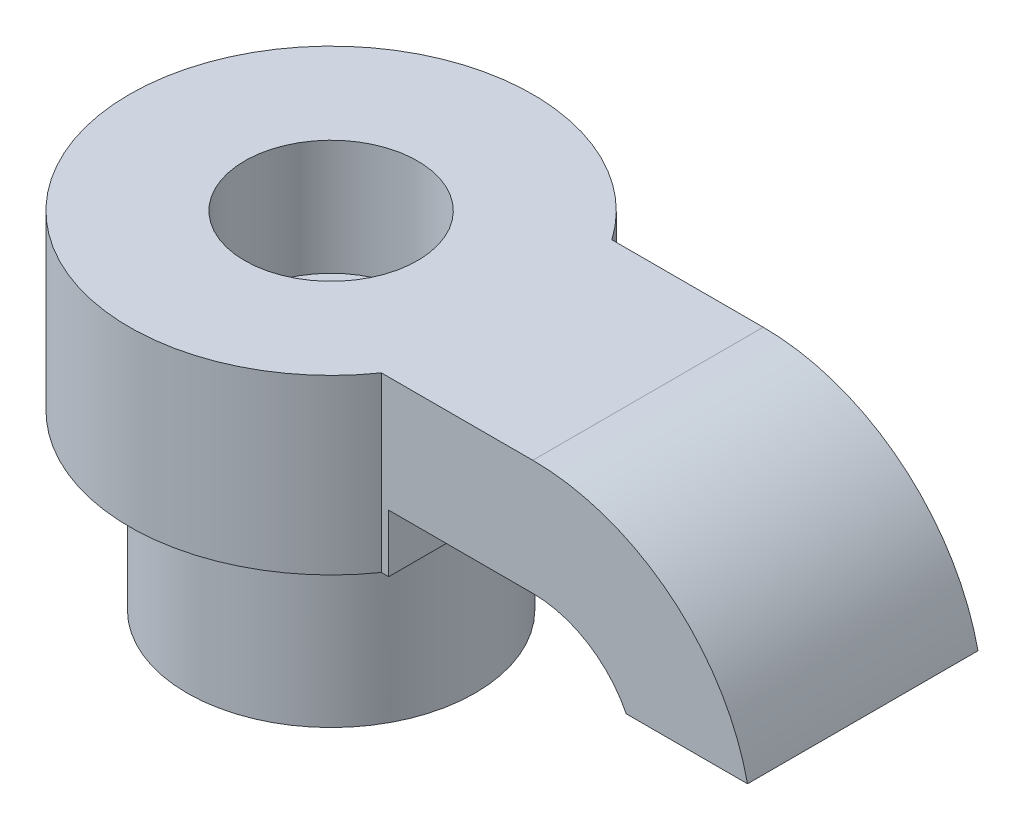
ISO-10303-21;
HEADER;
FILE_DESCRIPTION(('STEP AP214'),'2;1');
FILE_NAME('part.step','',(''),(''),'','','');
FILE_SCHEMA(('AUTOMOTIVE_DESIGN { 1 0 10303 214 1 1 1 1 }'));
ENDSEC;
DATA;
#1=APPLICATION_CONTEXT('core data for automotive mechanical design processes');
#2=APPLICATION_PROTOCOL_DEFINITION('international standard','automotive_design',2000,#1);
#3=PRODUCT_CONTEXT('',#1,'mechanical');
#4=PRODUCT('Part','Part','',(#3));
#5=PRODUCT_RELATED_PRODUCT_CATEGORY('part','',(#4));
#6=PRODUCT_DEFINITION_FORMATION('','',#4);
#7=PRODUCT_DEFINITION_CONTEXT('part definition',#1,'design');
#8=PRODUCT_DEFINITION('design','',#6,#7);
#9=PRODUCT_DEFINITION_SHAPE('','',#8);
#10=(LENGTH_UNIT() NAMED_UNIT(*) SI_UNIT(.MILLI.,.METRE.));
#11=(NAMED_UNIT(*) PLANE_ANGLE_UNIT() SI_UNIT($,.RADIAN.));
#12=(NAMED_UNIT(*) SI_UNIT($,.STERADIAN.) SOLID_ANGLE_UNIT());
#13=UNCERTAINTY_MEASURE_WITH_UNIT(LENGTH_MEASURE(1.E-05),#10,'distance_accuracy_value','');
#14=(GEOMETRIC_REPRESENTATION_CONTEXT(3) GLOBAL_UNCERTAINTY_ASSIGNED_CONTEXT((#13)) GLOBAL_UNIT_ASSIGNED_CONTEXT((#10,
#11,#12)) REPRESENTATION_CONTEXT('',''));
#15=CARTESIAN_POINT('',(0.,0.,0.));
#16=DIRECTION('',(0.,0.,1.));
#17=DIRECTION('',(1.,0.,0.));
#18=AXIS2_PLACEMENT_3D('',#15,#16,#17);
#19=CARTESIAN_POINT('',(-6.,-6.,4.));
#20=DIRECTION('',(0.,1.,0.));
#21=DIRECTION('',(0.,0.,1.));
#22=AXIS2_PLACEMENT_3D('',#19,#20,#21);
#23=PLANE('',#22);
#24=CARTESIAN_POINT('',(-6.,-6.,4.));
#25=DIRECTION('',(0.,1.,0.));
#26=DIRECTION('',(0.,0.,1.));
#27=AXIS2_PLACEMENT_3D('',#24,#25,#26);
#28=CIRCLE('',#27,7.);
#29=CARTESIAN_POINT('',(-0.255437353461972,-6.,0.));
#30=VERTEX_POINT('',#29);
#31=CARTESIAN_POINT('',(-0.255437353461972,-6.,8.));
#32=VERTEX_POINT('',#31);
#33=EDGE_CURVE('E129',#30,#32,#28,.T.);
#34=ORIENTED_EDGE('',*,*,#33,.F.);
#35=DIRECTION('',(-1.,0.,0.));
#36=VECTOR('',#35,1.);
#37=CARTESIAN_POINT('',(-0.255437353461972,-6.,0.));
#38=LINE('',#37,#36);
#39=CARTESIAN_POINT('',(0.,-6.,0.));
#40=VERTEX_POINT('',#39);
#41=EDGE_CURVE('E122',#40,#30,#38,.T.);
#42=ORIENTED_EDGE('',*,*,#41,.F.);
#43=DIRECTION('',(0.,0.,-1.));
#44=VECTOR('',#43,1.);
#45=CARTESIAN_POINT('',(0.,-6.,0.));
#46=LINE('',#45,#44);
#47=CARTESIAN_POINT('',(0.,-6.,8.));
#48=VERTEX_POINT('',#47);
#49=EDGE_CURVE('E132',#48,#40,#46,.T.);
#50=ORIENTED_EDGE('',*,*,#49,.F.);
#51=DIRECTION('',(1.,0.,0.));
#52=VECTOR('',#51,1.);
#53=CARTESIAN_POINT('',(0.,-6.,8.));
#54=LINE('',#53,#52);
#55=EDGE_CURVE('E114',#32,#48,#54,.T.);
#56=ORIENTED_EDGE('',*,*,#55,.F.);
#57=EDGE_LOOP('',(#34,#42,#50,#56));
#58=FACE_BOUND('',#57,.T.);
#59=CARTESIAN_POINT('',(-6.,-6.,4.));
#60=DIRECTION('',(0.,1.,0.));
#61=DIRECTION('',(0.,0.,1.));
#62=AXIS2_PLACEMENT_3D('',#59,#60,#61);
#63=CIRCLE('',#62,5.);
#64=CARTESIAN_POINT('',(-6.,-6.,9.));
#65=VERTEX_POINT('',#64);
#66=EDGE_CURVE('E11',#65,#65,#63,.F.);
#67=ORIENTED_EDGE('',*,*,#66,.F.);
#68=EDGE_LOOP('',(#67));
#69=FACE_BOUND('',#68,.T.);
#70=ADVANCED_FACE('F36',(#58,#69),#23,.F.);
#71=CARTESIAN_POINT('',(0.,-4.,8.));
#72=DIRECTION('',(0.,1.,0.));
#73=DIRECTION('',(0.,0.,1.));
#74=AXIS2_PLACEMENT_3D('',#71,#72,#73);
#75=PLANE('',#74);
#76=DIRECTION('',(1.,0.,0.));
#77=VECTOR('',#76,1.);
#78=CARTESIAN_POINT('',(0.,-4.,0.));
#79=LINE('',#78,#77);
#80=CARTESIAN_POINT('',(0.,-4.,0.));
#81=VERTEX_POINT('',#80);
#82=CARTESIAN_POINT('',(5.,-4.,0.));
#83=VERTEX_POINT('',#82);
#84=EDGE_CURVE('E147',#81,#83,#79,.T.);
#85=ORIENTED_EDGE('',*,*,#84,.T.);
#86=DIRECTION('',(0.,0.,-1.));
#87=VECTOR('',#86,1.);
#88=CARTESIAN_POINT('',(5.,-4.,8.));
#89=LINE('',#88,#87);
#90=CARTESIAN_POINT('',(5.,-4.,8.));
#91=VERTEX_POINT('',#90);
#92=EDGE_CURVE('E173',#91,#83,#89,.T.);
#93=ORIENTED_EDGE('',*,*,#92,.F.);
#94=DIRECTION('',(1.,0.,0.));
#95=VECTOR('',#94,1.);
#96=CARTESIAN_POINT('',(0.,-4.,8.));
#97=LINE('',#96,#95);
#98=CARTESIAN_POINT('',(0.,-4.,8.));
#99=VERTEX_POINT('',#98);
#100=EDGE_CURVE('E88',#99,#91,#97,.T.);
#101=ORIENTED_EDGE('',*,*,#100,.F.);
#102=DIRECTION('',(0.,0.,-1.));
#103=VECTOR('',#102,1.);
#104=CARTESIAN_POINT('',(0.,-4.,8.));
#105=LINE('',#104,#103);
#106=EDGE_CURVE('E46',#99,#81,#105,.T.);
#107=ORIENTED_EDGE('',*,*,#106,.T.);
#108=EDGE_LOOP('',(#85,#93,#101,#107));
#109=FACE_BOUND('',#108,.T.);
#110=ADVANCED_FACE('F38',(#109),#75,.F.);
#111=CARTESIAN_POINT('',(5.,-7.63014946104609,8.));
#112=DIRECTION('',(0.,0.,-1.));
#113=DIRECTION('',(-1.,0.,0.));
#114=AXIS2_PLACEMENT_3D('',#111,#112,#113);
#115=CYLINDRICAL_SURFACE('',#114,3.63014946104609);
#116=CARTESIAN_POINT('',(5.,-7.63014946104609,0.));
#117=DIRECTION('',(0.,0.,-1.));
#118=DIRECTION('',(-1.,0.,0.));
#119=AXIS2_PLACEMENT_3D('',#116,#117,#118);
#120=CIRCLE('',#119,3.63014946104609);
#121=CARTESIAN_POINT('',(8.24354710836522,-6.,0.));
#122=VERTEX_POINT('',#121);
#123=EDGE_CURVE('E162',#83,#122,#120,.T.);
#124=ORIENTED_EDGE('',*,*,#123,.T.);
#125=DIRECTION('',(0.,0.,-1.));
#126=VECTOR('',#125,1.);
#127=CARTESIAN_POINT('',(8.24354710836522,-6.,8.));
#128=LINE('',#127,#126);
#129=CARTESIAN_POINT('',(8.24354710836522,-6.,8.));
#130=VERTEX_POINT('',#129);
#131=EDGE_CURVE('E171',#130,#122,#128,.T.);
#132=ORIENTED_EDGE('',*,*,#131,.F.);
#133=CARTESIAN_POINT('',(5.,-7.63014946104609,8.));
#134=DIRECTION('',(0.,0.,-1.));
#135=DIRECTION('',(-1.,0.,0.));
#136=AXIS2_PLACEMENT_3D('',#133,#134,#135);
#137=CIRCLE('',#136,3.63014946104609);
#138=EDGE_CURVE('E155',#91,#130,#137,.T.);
#139=ORIENTED_EDGE('',*,*,#138,.F.);
#140=ORIENTED_EDGE('',*,*,#92,.T.);
#141=EDGE_LOOP('',(#124,#132,#139,#140));
#142=FACE_BOUND('',#141,.T.);
#143=ADVANCED_FACE('F194',(#142),#115,.F.);
#144=CARTESIAN_POINT('',(8.24354710836522,-6.,8.));
#145=DIRECTION('',(0.,1.,0.));
#146=DIRECTION('',(0.,0.,1.));
#147=AXIS2_PLACEMENT_3D('',#144,#145,#146);
#148=PLANE('',#147);
#149=DIRECTION('',(1.,0.,0.));
#150=VECTOR('',#149,1.);
#151=CARTESIAN_POINT('',(8.24354710836522,-6.,0.));
#152=LINE('',#151,#150);
#153=CARTESIAN_POINT('',(12.4539783694718,-6.,0.));
#154=VERTEX_POINT('',#153);
#155=EDGE_CURVE('E75',#122,#154,#152,.T.);
#156=ORIENTED_EDGE('',*,*,#155,.T.);
#157=DIRECTION('',(0.,0.,-1.));
#158=VECTOR('',#157,1.);
#159=CARTESIAN_POINT('',(12.4539783694718,-6.,8.));
#160=LINE('',#159,#158);
#161=CARTESIAN_POINT('',(12.4539783694718,-6.,8.));
#162=VERTEX_POINT('',#161);
#163=EDGE_CURVE('E169',#162,#154,#160,.T.);
#164=ORIENTED_EDGE('',*,*,#163,.F.);
#165=DIRECTION('',(1.,0.,0.));
#166=VECTOR('',#165,1.);
#167=CARTESIAN_POINT('',(8.24354710836522,-6.,8.));
#168=LINE('',#167,#166);
#169=EDGE_CURVE('E157',#130,#162,#168,.T.);
#170=ORIENTED_EDGE('',*,*,#169,.F.);
#171=ORIENTED_EDGE('',*,*,#131,.T.);
#172=EDGE_LOOP('',(#156,#164,#170,#171));
#173=FACE_BOUND('',#172,.T.);
#174=ADVANCED_FACE('F197',(#173),#148,.F.);
#175=CARTESIAN_POINT('',(5.,-7.63014946104609,8.));
#176=DIRECTION('',(0.,0.,-1.));
#177=DIRECTION('',(-1.,0.,0.));
#178=AXIS2_PLACEMENT_3D('',#175,#176,#177);
#179=CYLINDRICAL_SURFACE('',#178,7.63014946104609);
#180=CARTESIAN_POINT('',(5.,-7.63014946104609,0.));
#181=DIRECTION('',(0.,0.,1.));
#182=DIRECTION('',(-1.,0.,0.));
#183=AXIS2_PLACEMENT_3D('',#180,#181,#182);
#184=CIRCLE('',#183,7.63014946104609);
#185=CARTESIAN_POINT('',(5.,0.,0.));
#186=VERTEX_POINT('',#185);
#187=EDGE_CURVE('E81',#154,#186,#184,.T.);
#188=ORIENTED_EDGE('',*,*,#187,.T.);
#189=DIRECTION('',(0.,0.,-1.));
#190=VECTOR('',#189,1.);
#191=CARTESIAN_POINT('',(5.,0.,8.));
#192=LINE('',#191,#190);
#193=CARTESIAN_POINT('',(5.,0.,8.));
#194=VERTEX_POINT('',#193);
#195=EDGE_CURVE('E161',#194,#186,#192,.T.);
#196=ORIENTED_EDGE('',*,*,#195,.F.);
#197=CARTESIAN_POINT('',(5.,-7.63014946104609,8.));
#198=DIRECTION('',(0.,0.,1.));
#199=DIRECTION('',(-1.,0.,0.));
#200=AXIS2_PLACEMENT_3D('',#197,#198,#199);
#201=CIRCLE('',#200,7.63014946104609);
#202=EDGE_CURVE('E54',#162,#194,#201,.T.);
#203=ORIENTED_EDGE('',*,*,#202,.F.);
#204=ORIENTED_EDGE('',*,*,#163,.T.);
#205=EDGE_LOOP('',(#188,#196,#203,#204));
#206=FACE_BOUND('',#205,.T.);
#207=ADVANCED_FACE('F198',(#206),#179,.T.);
#208=CARTESIAN_POINT('',(0.,0.,8.));
#209=DIRECTION('',(0.,-1.,0.));
#210=DIRECTION('',(0.,0.,-1.));
#211=AXIS2_PLACEMENT_3D('',#208,#209,#210);
#212=PLANE('',#211);
#213=CARTESIAN_POINT('',(-6.,0.,4.));
#214=DIRECTION('',(0.,1.,0.));
#215=DIRECTION('',(0.,0.,1.));
#216=AXIS2_PLACEMENT_3D('',#213,#214,#215);
#217=CIRCLE('',#216,3.00000000000001);
#218=CARTESIAN_POINT('',(-6.,0.,7.00000000000001));
#219=VERTEX_POINT('',#218);
#220=EDGE_CURVE('E348',#219,#219,#217,.T.);
#221=ORIENTED_EDGE('',*,*,#220,.F.);
#222=EDGE_LOOP('',(#221));
#223=FACE_BOUND('',#222,.T.);
#224=DIRECTION('',(-1.,0.,0.));
#225=VECTOR('',#224,1.);
#226=CARTESIAN_POINT('',(0.,0.,0.));
#227=LINE('',#226,#225);
#228=CARTESIAN_POINT('',(-0.255437353461972,0.,0.));
#229=VERTEX_POINT('',#228);
#230=EDGE_CURVE('E166',#186,#229,#227,.T.);
#231=ORIENTED_EDGE('',*,*,#230,.T.);
#232=CARTESIAN_POINT('',(-6.,0.,4.));
#233=DIRECTION('',(0.,1.,0.));
#234=DIRECTION('',(0.,0.,1.));
#235=AXIS2_PLACEMENT_3D('',#232,#233,#234);
#236=CIRCLE('',#235,7.);
#237=CARTESIAN_POINT('',(-0.255437353461972,0.,8.));
#238=VERTEX_POINT('',#237);
#239=EDGE_CURVE('E137',#229,#238,#236,.T.);
#240=ORIENTED_EDGE('',*,*,#239,.T.);
#241=DIRECTION('',(-1.,0.,0.));
#242=VECTOR('',#241,1.);
#243=CARTESIAN_POINT('',(0.,0.,8.));
#244=LINE('',#243,#242);
#245=EDGE_CURVE('E116',#194,#238,#244,.T.);
#246=ORIENTED_EDGE('',*,*,#245,.F.);
#247=ORIENTED_EDGE('',*,*,#195,.T.);
#248=EDGE_LOOP('',(#231,#240,#246,#247));
#249=FACE_BOUND('',#248,.T.);
#250=ADVANCED_FACE('F201',(#223,#249),#212,.F.);
#251=CARTESIAN_POINT('',(5.,-7.63014946104609,8.));
#252=DIRECTION('',(0.,0.,-1.));
#253=DIRECTION('',(-1.,0.,0.));
#254=AXIS2_PLACEMENT_3D('',#251,#252,#253);
#255=PLANE('',#254);
#256=ORIENTED_EDGE('',*,*,#245,.T.);
#257=DIRECTION('',(0.,1.,0.));
#258=VECTOR('',#257,1.);
#259=CARTESIAN_POINT('',(-0.255437353461972,-6.,8.));
#260=LINE('',#259,#258);
#261=EDGE_CURVE('E111',#32,#238,#260,.T.);
#262=ORIENTED_EDGE('',*,*,#261,.F.);
#263=ORIENTED_EDGE('',*,*,#55,.T.);
#264=DIRECTION('',(0.,1.,0.));
#265=VECTOR('',#264,1.);
#266=CARTESIAN_POINT('',(0.,-6.,8.));
#267=LINE('',#266,#265);
#268=EDGE_CURVE('E121',#48,#99,#267,.T.);
#269=ORIENTED_EDGE('',*,*,#268,.T.);
#270=ORIENTED_EDGE('',*,*,#100,.T.);
#271=ORIENTED_EDGE('',*,*,#138,.T.);
#272=ORIENTED_EDGE('',*,*,#169,.T.);
#273=ORIENTED_EDGE('',*,*,#202,.T.);
#274=EDGE_LOOP('',(#256,#262,#263,#269,#270,#271,#272,#273));
#275=FACE_BOUND('',#274,.T.);
#276=ADVANCED_FACE('F113',(#275),#255,.F.);
#277=CARTESIAN_POINT('',(5.,-7.63014946104609,0.));
#278=DIRECTION('',(0.,0.,-1.));
#279=DIRECTION('',(-1.,0.,0.));
#280=AXIS2_PLACEMENT_3D('',#277,#278,#279);
#281=PLANE('',#280);
#282=ORIENTED_EDGE('',*,*,#84,.F.);
#283=DIRECTION('',(0.,1.,0.));
#284=VECTOR('',#283,1.);
#285=CARTESIAN_POINT('',(0.,-6.,0.));
#286=LINE('',#285,#284);
#287=EDGE_CURVE('E148',#40,#81,#286,.T.);
#288=ORIENTED_EDGE('',*,*,#287,.F.);
#289=ORIENTED_EDGE('',*,*,#41,.T.);
#290=DIRECTION('',(0.,1.,0.));
#291=VECTOR('',#290,1.);
#292=CARTESIAN_POINT('',(-0.255437353461972,-6.,0.));
#293=LINE('',#292,#291);
#294=EDGE_CURVE('E136',#30,#229,#293,.T.);
#295=ORIENTED_EDGE('',*,*,#294,.T.);
#296=ORIENTED_EDGE('',*,*,#230,.F.);
#297=ORIENTED_EDGE('',*,*,#187,.F.);
#298=ORIENTED_EDGE('',*,*,#155,.F.);
#299=ORIENTED_EDGE('',*,*,#123,.F.);
#300=EDGE_LOOP('',(#282,#288,#289,#295,#296,#297,#298,#299));
#301=FACE_BOUND('',#300,.T.);
#302=ADVANCED_FACE('F191',(#301),#281,.T.);
#303=CARTESIAN_POINT('',(0.,-6.,0.));
#304=DIRECTION('',(1.,0.,0.));
#305=DIRECTION('',(0.,0.,-1.));
#306=AXIS2_PLACEMENT_3D('',#303,#304,#305);
#307=PLANE('',#306);
#308=ORIENTED_EDGE('',*,*,#106,.F.);
#309=ORIENTED_EDGE('',*,*,#268,.F.);
#310=ORIENTED_EDGE('',*,*,#49,.T.);
#311=ORIENTED_EDGE('',*,*,#287,.T.);
#312=EDGE_LOOP('',(#308,#309,#310,#311));
#313=FACE_BOUND('',#312,.T.);
#314=ADVANCED_FACE('F188',(#313),#307,.T.);
#315=CARTESIAN_POINT('',(-6.,-6.,4.));
#316=DIRECTION('',(0.,1.,0.));
#317=DIRECTION('',(0.,0.,1.));
#318=AXIS2_PLACEMENT_3D('',#315,#316,#317);
#319=CYLINDRICAL_SURFACE('',#318,7.);
#320=ORIENTED_EDGE('',*,*,#239,.F.);
#321=ORIENTED_EDGE('',*,*,#294,.F.);
#322=ORIENTED_EDGE('',*,*,#33,.T.);
#323=ORIENTED_EDGE('',*,*,#261,.T.);
#324=EDGE_LOOP('',(#320,#321,#322,#323));
#325=FACE_BOUND('',#324,.T.);
#326=ADVANCED_FACE('F134',(#325),#319,.T.);
#327=CARTESIAN_POINT('',(-6.,-12.,4.));
#328=DIRECTION('',(0.,1.,0.));
#329=DIRECTION('',(0.,0.,1.));
#330=AXIS2_PLACEMENT_3D('',#327,#328,#329);
#331=CYLINDRICAL_SURFACE('',#330,5.);
#332=CARTESIAN_POINT('',(-6.,-12.,4.));
#333=DIRECTION('',(0.,-1.,0.));
#334=DIRECTION('',(0.,0.,-1.));
#335=AXIS2_PLACEMENT_3D('',#332,#333,#334);
#336=CIRCLE('',#335,5.);
#337=CARTESIAN_POINT('',(-6.,-12.,-1.));
#338=VERTEX_POINT('',#337);
#339=EDGE_CURVE('E139',#338,#338,#336,.T.);
#340=ORIENTED_EDGE('',*,*,#339,.F.);
#341=EDGE_LOOP('',(#340));
#342=FACE_BOUND('',#341,.T.);
#343=ORIENTED_EDGE('',*,*,#66,.T.);
#344=EDGE_LOOP('',(#343));
#345=FACE_BOUND('',#344,.T.);
#346=ADVANCED_FACE('F220',(#342,#345),#331,.T.);
#347=CARTESIAN_POINT('',(-6.,-12.,4.));
#348=DIRECTION('',(0.,-1.,0.));
#349=DIRECTION('',(0.,0.,-1.));
#350=AXIS2_PLACEMENT_3D('',#347,#348,#349);
#351=PLANE('',#350);
#352=CARTESIAN_POINT('',(-6.,-12.,4.));
#353=DIRECTION('',(0.,-1.,0.));
#354=DIRECTION('',(0.,0.,-1.));
#355=AXIS2_PLACEMENT_3D('',#352,#353,#354);
#356=CIRCLE('',#355,1.50000000000001);
#357=CARTESIAN_POINT('',(-6.,-12.,2.49999999999999));
#358=VERTEX_POINT('',#357);
#359=EDGE_CURVE('E40',#358,#358,#356,.T.);
#360=ORIENTED_EDGE('',*,*,#359,.F.);
#361=EDGE_LOOP('',(#360));
#362=FACE_BOUND('',#361,.T.);
#363=ORIENTED_EDGE('',*,*,#339,.T.);
#364=EDGE_LOOP('',(#363));
#365=FACE_BOUND('',#364,.T.);
#366=ADVANCED_FACE('F244',(#362,#365),#351,.T.);
#367=CARTESIAN_POINT('',(-6.,0.,4.));
#368=DIRECTION('',(0.,1.,0.));
#369=DIRECTION('',(0.,0.,1.));
#370=AXIS2_PLACEMENT_3D('',#367,#368,#369);
#371=CYLINDRICAL_SURFACE('',#370,1.50000000000001);
#372=ORIENTED_EDGE('',*,*,#359,.T.);
#373=EDGE_LOOP('',(#372));
#374=FACE_BOUND('',#373,.T.);
#375=CARTESIAN_POINT('',(-6.,-4.,4.));
#376=DIRECTION('',(0.,1.,0.));
#377=DIRECTION('',(0.,0.,1.));
#378=AXIS2_PLACEMENT_3D('',#375,#376,#377);
#379=CIRCLE('',#378,1.50000000000001);
#380=CARTESIAN_POINT('',(-6.,-4.,5.50000000000001));
#381=VERTEX_POINT('',#380);
#382=EDGE_CURVE('E350',#381,#381,#379,.T.);
#383=ORIENTED_EDGE('',*,*,#382,.T.);
#384=EDGE_LOOP('',(#383));
#385=FACE_BOUND('',#384,.T.);
#386=ADVANCED_FACE('F251',(#374,#385),#371,.F.);
#387=CARTESIAN_POINT('',(-4.49999999999999,-4.,4.));
#388=DIRECTION('',(0.,-1.,0.));
#389=DIRECTION('',(0.,0.,-1.));
#390=AXIS2_PLACEMENT_3D('',#387,#388,#389);
#391=PLANE('',#390);
#392=ORIENTED_EDGE('',*,*,#382,.F.);
#393=EDGE_LOOP('',(#392));
#394=FACE_BOUND('',#393,.T.);
#395=CARTESIAN_POINT('',(-6.,-4.,4.));
#396=DIRECTION('',(0.,1.,0.));
#397=DIRECTION('',(0.,0.,1.));
#398=AXIS2_PLACEMENT_3D('',#395,#396,#397);
#399=CIRCLE('',#398,3.00000000000001);
#400=CARTESIAN_POINT('',(-6.,-4.,7.00000000000001));
#401=VERTEX_POINT('',#400);
#402=EDGE_CURVE('E346',#401,#401,#399,.T.);
#403=ORIENTED_EDGE('',*,*,#402,.T.);
#404=EDGE_LOOP('',(#403));
#405=FACE_BOUND('',#404,.T.);
#406=ADVANCED_FACE('F259',(#394,#405),#391,.F.);
#407=CARTESIAN_POINT('',(-6.,0.,4.));
#408=DIRECTION('',(0.,1.,0.));
#409=DIRECTION('',(0.,0.,1.));
#410=AXIS2_PLACEMENT_3D('',#407,#408,#409);
#411=CYLINDRICAL_SURFACE('',#410,3.00000000000001);
#412=ORIENTED_EDGE('',*,*,#402,.F.);
#413=EDGE_LOOP('',(#412));
#414=FACE_BOUND('',#413,.T.);
#415=ORIENTED_EDGE('',*,*,#220,.T.);
#416=EDGE_LOOP('',(#415));
#417=FACE_BOUND('',#416,.T.);
#418=ADVANCED_FACE('F266',(#414,#417),#411,.F.);
#419=CLOSED_SHELL('',(#70,#110,#143,#174,#207,#250,#276,#302,#314,#326,#346,#366,#386,#406,#418));
#420=MANIFOLD_SOLID_BREP('B2',#419);
#421=ADVANCED_BREP_SHAPE_REPRESENTATION('',(#18,#420),#14);
#422=SHAPE_DEFINITION_REPRESENTATION(#9,#421);
ENDSEC;
END-ISO-10303-21;
